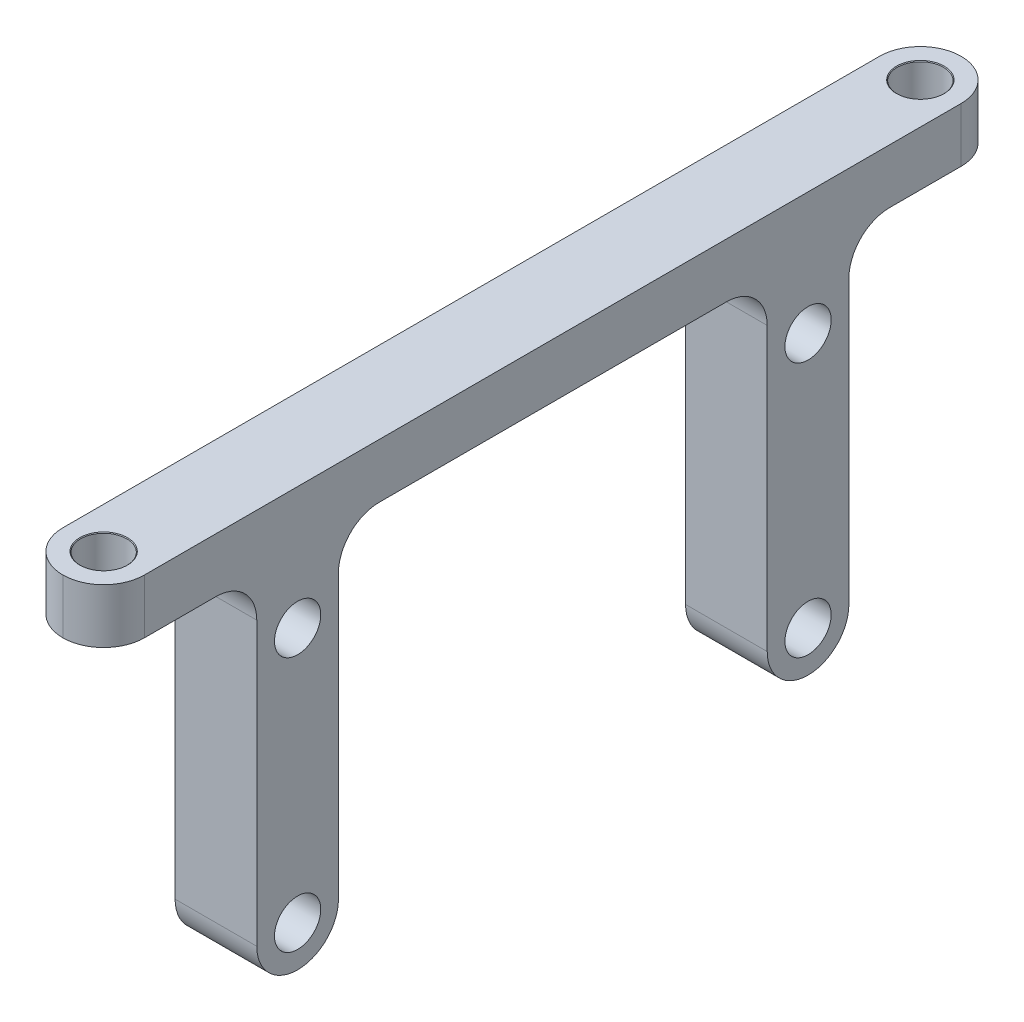
ISO-10303-21;
HEADER;
FILE_DESCRIPTION(('STEP AP214'),'2;1');
FILE_NAME('part.step','',(''),(''),'','','');
FILE_SCHEMA(('AUTOMOTIVE_DESIGN { 1 0 10303 214 1 1 1 1 }'));
ENDSEC;
DATA;
#1=APPLICATION_CONTEXT('core data for automotive mechanical design processes');
#2=APPLICATION_PROTOCOL_DEFINITION('international standard','automotive_design',2000,#1);
#3=PRODUCT_CONTEXT('',#1,'mechanical');
#4=PRODUCT('Part','Part','',(#3));
#5=PRODUCT_RELATED_PRODUCT_CATEGORY('part','',(#4));
#6=PRODUCT_DEFINITION_FORMATION('','',#4);
#7=PRODUCT_DEFINITION_CONTEXT('part definition',#1,'design');
#8=PRODUCT_DEFINITION('design','',#6,#7);
#9=PRODUCT_DEFINITION_SHAPE('','',#8);
#10=(LENGTH_UNIT() NAMED_UNIT(*) SI_UNIT(.MILLI.,.METRE.));
#11=(NAMED_UNIT(*) PLANE_ANGLE_UNIT() SI_UNIT($,.RADIAN.));
#12=(NAMED_UNIT(*) SI_UNIT($,.STERADIAN.) SOLID_ANGLE_UNIT());
#13=UNCERTAINTY_MEASURE_WITH_UNIT(LENGTH_MEASURE(1.E-05),#10,'distance_accuracy_value','');
#14=(GEOMETRIC_REPRESENTATION_CONTEXT(3) GLOBAL_UNCERTAINTY_ASSIGNED_CONTEXT((#13)) GLOBAL_UNIT_ASSIGNED_CONTEXT((#10,
#11,#12)) REPRESENTATION_CONTEXT('',''));
#15=CARTESIAN_POINT('',(0.,0.,0.));
#16=DIRECTION('',(0.,0.,1.));
#17=DIRECTION('',(1.,0.,0.));
#18=AXIS2_PLACEMENT_3D('',#15,#16,#17);
#19=CARTESIAN_POINT('',(6.,0.,0.));
#20=DIRECTION('',(-1.,0.,0.));
#21=DIRECTION('',(0.,0.,1.));
#22=AXIS2_PLACEMENT_3D('',#19,#20,#21);
#23=PLANE('',#22);
#24=DIRECTION('',(0.,0.,-1.));
#25=VECTOR('',#24,1.);
#26=CARTESIAN_POINT('',(6.,0.,-33.));
#27=LINE('',#26,#25);
#28=CARTESIAN_POINT('',(6.,0.,-24.75));
#29=VERTEX_POINT('',#28);
#30=CARTESIAN_POINT('',(6.,0.,-30.));
#31=VERTEX_POINT('',#30);
#32=EDGE_CURVE('E337',#29,#31,#27,.T.);
#33=ORIENTED_EDGE('',*,*,#32,.T.);
#34=DIRECTION('',(0.,1.,0.));
#35=VECTOR('',#34,1.);
#36=CARTESIAN_POINT('',(6.,0.,-30.));
#37=LINE('',#36,#35);
#38=CARTESIAN_POINT('',(6.,3.99999999999999,-30.));
#39=VERTEX_POINT('',#38);
#40=EDGE_CURVE('E296',#31,#39,#37,.T.);
#41=ORIENTED_EDGE('',*,*,#40,.T.);
#42=DIRECTION('',(0.,0.,1.));
#43=VECTOR('',#42,1.);
#44=CARTESIAN_POINT('',(6.,3.99999999999999,33.));
#45=LINE('',#44,#43);
#46=CARTESIAN_POINT('',(6.,3.99999999999999,30.));
#47=VERTEX_POINT('',#46);
#48=EDGE_CURVE('E331',#39,#47,#45,.T.);
#49=ORIENTED_EDGE('',*,*,#48,.T.);
#50=DIRECTION('',(0.,-1.,0.));
#51=VECTOR('',#50,1.);
#52=CARTESIAN_POINT('',(6.,0.,30.));
#53=LINE('',#52,#51);
#54=CARTESIAN_POINT('',(6.,0.,30.));
#55=VERTEX_POINT('',#54);
#56=EDGE_CURVE('E294',#47,#55,#53,.T.);
#57=ORIENTED_EDGE('',*,*,#56,.T.);
#58=DIRECTION('',(0.,0.,-1.));
#59=VECTOR('',#58,1.);
#60=CARTESIAN_POINT('',(6.,0.,21.75));
#61=LINE('',#60,#59);
#62=CARTESIAN_POINT('',(6.,0.,24.75));
#63=VERTEX_POINT('',#62);
#64=EDGE_CURVE('E336',#55,#63,#61,.T.);
#65=ORIENTED_EDGE('',*,*,#64,.T.);
#66=CARTESIAN_POINT('',(6.,-3.,24.75));
#67=DIRECTION('',(-1.,0.,0.));
#68=DIRECTION('',(0.,0.,1.));
#69=AXIS2_PLACEMENT_3D('',#66,#67,#68);
#70=CIRCLE('',#69,3.);
#71=CARTESIAN_POINT('',(6.,-3.,21.75));
#72=VERTEX_POINT('',#71);
#73=EDGE_CURVE('E292',#63,#72,#70,.T.);
#74=ORIENTED_EDGE('',*,*,#73,.T.);
#75=DIRECTION('',(0.,-1.,0.));
#76=VECTOR('',#75,1.);
#77=CARTESIAN_POINT('',(6.,-26.75,21.75));
#78=LINE('',#77,#76);
#79=CARTESIAN_POINT('',(6.,-23.75,21.75));
#80=VERTEX_POINT('',#79);
#81=EDGE_CURVE('E196',#72,#80,#78,.T.);
#82=ORIENTED_EDGE('',*,*,#81,.T.);
#83=CARTESIAN_POINT('',(6.,-23.75,18.75));
#84=DIRECTION('',(-1.,0.,0.));
#85=DIRECTION('',(0.,0.,1.));
#86=AXIS2_PLACEMENT_3D('',#83,#84,#85);
#87=CIRCLE('',#86,3.);
#88=CARTESIAN_POINT('',(6.,-26.75,18.75));
#89=VERTEX_POINT('',#88);
#90=EDGE_CURVE('E184',#80,#89,#87,.F.);
#91=ORIENTED_EDGE('',*,*,#90,.T.);
#92=CARTESIAN_POINT('',(6.,-23.75,18.75));
#93=DIRECTION('',(-1.,0.,0.));
#94=DIRECTION('',(0.,0.,1.));
#95=AXIS2_PLACEMENT_3D('',#92,#93,#94);
#96=CIRCLE('',#95,3.);
#97=CARTESIAN_POINT('',(6.,-23.75,15.75));
#98=VERTEX_POINT('',#97);
#99=EDGE_CURVE('E236',#89,#98,#96,.F.);
#100=ORIENTED_EDGE('',*,*,#99,.T.);
#101=DIRECTION('',(0.,1.,0.));
#102=VECTOR('',#101,1.);
#103=CARTESIAN_POINT('',(6.,0.,15.75));
#104=LINE('',#103,#102);
#105=CARTESIAN_POINT('',(6.,-3.,15.75));
#106=VERTEX_POINT('',#105);
#107=EDGE_CURVE('E219',#98,#106,#104,.T.);
#108=ORIENTED_EDGE('',*,*,#107,.T.);
#109=CARTESIAN_POINT('',(6.,-3.,12.75));
#110=DIRECTION('',(-1.,0.,0.));
#111=DIRECTION('',(0.,0.,1.));
#112=AXIS2_PLACEMENT_3D('',#109,#110,#111);
#113=CIRCLE('',#112,3.);
#114=CARTESIAN_POINT('',(6.,0.,12.75));
#115=VERTEX_POINT('',#114);
#116=EDGE_CURVE('E287',#106,#115,#113,.T.);
#117=ORIENTED_EDGE('',*,*,#116,.T.);
#118=DIRECTION('',(0.,0.,-1.));
#119=VECTOR('',#118,1.);
#120=CARTESIAN_POINT('',(6.,0.,-15.75));
#121=LINE('',#120,#119);
#122=CARTESIAN_POINT('',(6.,0.,-12.75));
#123=VERTEX_POINT('',#122);
#124=EDGE_CURVE('E361',#115,#123,#121,.T.);
#125=ORIENTED_EDGE('',*,*,#124,.T.);
#126=CARTESIAN_POINT('',(6.,-3.,-12.75));
#127=DIRECTION('',(-1.,0.,0.));
#128=DIRECTION('',(0.,0.,1.));
#129=AXIS2_PLACEMENT_3D('',#126,#127,#128);
#130=CIRCLE('',#129,3.);
#131=CARTESIAN_POINT('',(6.,-3.,-15.75));
#132=VERTEX_POINT('',#131);
#133=EDGE_CURVE('E283',#123,#132,#130,.T.);
#134=ORIENTED_EDGE('',*,*,#133,.T.);
#135=DIRECTION('',(0.,-1.,0.));
#136=VECTOR('',#135,1.);
#137=CARTESIAN_POINT('',(6.,-26.75,-15.75));
#138=LINE('',#137,#136);
#139=CARTESIAN_POINT('',(6.,-23.75,-15.75));
#140=VERTEX_POINT('',#139);
#141=EDGE_CURVE('E360',#132,#140,#138,.T.);
#142=ORIENTED_EDGE('',*,*,#141,.T.);
#143=CARTESIAN_POINT('',(6.,-23.75,-18.75));
#144=DIRECTION('',(-1.,0.,0.));
#145=DIRECTION('',(0.,0.,1.));
#146=AXIS2_PLACEMENT_3D('',#143,#144,#145);
#147=CIRCLE('',#146,3.);
#148=CARTESIAN_POINT('',(6.,-26.75,-18.75));
#149=VERTEX_POINT('',#148);
#150=EDGE_CURVE('E238',#140,#149,#147,.F.);
#151=ORIENTED_EDGE('',*,*,#150,.T.);
#152=CARTESIAN_POINT('',(6.,-23.75,-18.75));
#153=DIRECTION('',(-1.,0.,0.));
#154=DIRECTION('',(0.,0.,1.));
#155=AXIS2_PLACEMENT_3D('',#152,#153,#154);
#156=CIRCLE('',#155,3.);
#157=CARTESIAN_POINT('',(6.,-23.75,-21.75));
#158=VERTEX_POINT('',#157);
#159=EDGE_CURVE('E240',#149,#158,#156,.F.);
#160=ORIENTED_EDGE('',*,*,#159,.T.);
#161=DIRECTION('',(0.,1.,0.));
#162=VECTOR('',#161,1.);
#163=CARTESIAN_POINT('',(6.,0.,-21.75));
#164=LINE('',#163,#162);
#165=CARTESIAN_POINT('',(6.,-3.,-21.75));
#166=VERTEX_POINT('',#165);
#167=EDGE_CURVE('E194',#158,#166,#164,.T.);
#168=ORIENTED_EDGE('',*,*,#167,.T.);
#169=CARTESIAN_POINT('',(6.,-3.,-24.75));
#170=DIRECTION('',(-1.,0.,0.));
#171=DIRECTION('',(0.,0.,1.));
#172=AXIS2_PLACEMENT_3D('',#169,#170,#171);
#173=CIRCLE('',#172,3.);
#174=EDGE_CURVE('E279',#166,#29,#173,.T.);
#175=ORIENTED_EDGE('',*,*,#174,.T.);
#176=EDGE_LOOP('',(#33,#41,#49,#57,#65,#74,#82,#91,#100,#108,#117,#125,#134,#142,#151,#160,#168,#175));
#177=FACE_BOUND('',#176,.T.);
#178=CARTESIAN_POINT('',(6.,-5.00000000000001,-18.75));
#179=DIRECTION('',(1.,0.,0.));
#180=DIRECTION('',(0.,0.,-1.));
#181=AXIS2_PLACEMENT_3D('',#178,#179,#180);
#182=CIRCLE('',#181,1.7);
#183=CARTESIAN_POINT('',(6.,-5.00000000000001,-20.45));
#184=VERTEX_POINT('',#183);
#185=EDGE_CURVE('E346',#184,#184,#182,.T.);
#186=ORIENTED_EDGE('',*,*,#185,.F.);
#187=EDGE_LOOP('',(#186));
#188=FACE_BOUND('',#187,.T.);
#189=CARTESIAN_POINT('',(6.,-23.75,-18.75));
#190=DIRECTION('',(1.,0.,0.));
#191=DIRECTION('',(0.,0.,-1.));
#192=AXIS2_PLACEMENT_3D('',#189,#190,#191);
#193=CIRCLE('',#192,1.7);
#194=CARTESIAN_POINT('',(6.,-23.75,-20.45));
#195=VERTEX_POINT('',#194);
#196=EDGE_CURVE('E375',#195,#195,#193,.T.);
#197=ORIENTED_EDGE('',*,*,#196,.F.);
#198=EDGE_LOOP('',(#197));
#199=FACE_BOUND('',#198,.T.);
#200=CARTESIAN_POINT('',(6.,-23.75,18.75));
#201=DIRECTION('',(1.,0.,0.));
#202=DIRECTION('',(0.,0.,1.));
#203=AXIS2_PLACEMENT_3D('',#200,#201,#202);
#204=CIRCLE('',#203,1.7);
#205=CARTESIAN_POINT('',(6.,-23.75,20.45));
#206=VERTEX_POINT('',#205);
#207=EDGE_CURVE('E381',#206,#206,#204,.T.);
#208=ORIENTED_EDGE('',*,*,#207,.F.);
#209=EDGE_LOOP('',(#208));
#210=FACE_BOUND('',#209,.T.);
#211=CARTESIAN_POINT('',(6.,-5.00000000000001,18.75));
#212=DIRECTION('',(1.,0.,0.));
#213=DIRECTION('',(0.,0.,1.));
#214=AXIS2_PLACEMENT_3D('',#211,#212,#213);
#215=CIRCLE('',#214,1.7);
#216=CARTESIAN_POINT('',(6.,-5.00000000000001,20.45));
#217=VERTEX_POINT('',#216);
#218=EDGE_CURVE('E387',#217,#217,#215,.T.);
#219=ORIENTED_EDGE('',*,*,#218,.F.);
#220=EDGE_LOOP('',(#219));
#221=FACE_BOUND('',#220,.T.);
#222=ADVANCED_FACE('F37',(#177,#188,#199,#210,#221),#23,.F.);
#223=CARTESIAN_POINT('',(0.,0.,0.));
#224=DIRECTION('',(-1.,0.,0.));
#225=DIRECTION('',(0.,0.,1.));
#226=AXIS2_PLACEMENT_3D('',#223,#224,#225);
#227=PLANE('',#226);
#228=CARTESIAN_POINT('',(0.,-23.75,18.75));
#229=DIRECTION('',(1.,0.,0.));
#230=DIRECTION('',(0.,0.,1.));
#231=AXIS2_PLACEMENT_3D('',#228,#229,#230);
#232=CIRCLE('',#231,1.7);
#233=CARTESIAN_POINT('',(0.,-23.75,20.45));
#234=VERTEX_POINT('',#233);
#235=EDGE_CURVE('E384',#234,#234,#232,.T.);
#236=ORIENTED_EDGE('',*,*,#235,.T.);
#237=EDGE_LOOP('',(#236));
#238=FACE_BOUND('',#237,.T.);
#239=CARTESIAN_POINT('',(0.,-5.00000000000001,-18.75));
#240=DIRECTION('',(1.,0.,0.));
#241=DIRECTION('',(0.,0.,-1.));
#242=AXIS2_PLACEMENT_3D('',#239,#240,#241);
#243=CIRCLE('',#242,1.7);
#244=CARTESIAN_POINT('',(0.,-5.00000000000001,-20.45));
#245=VERTEX_POINT('',#244);
#246=EDGE_CURVE('E372',#245,#245,#243,.T.);
#247=ORIENTED_EDGE('',*,*,#246,.T.);
#248=EDGE_LOOP('',(#247));
#249=FACE_BOUND('',#248,.T.);
#250=DIRECTION('',(0.,0.,1.));
#251=VECTOR('',#250,1.);
#252=CARTESIAN_POINT('',(0.,3.99999999999999,33.));
#253=LINE('',#252,#251);
#254=CARTESIAN_POINT('',(0.,3.99999999999999,-30.));
#255=VERTEX_POINT('',#254);
#256=CARTESIAN_POINT('',(0.,3.99999999999999,30.));
#257=VERTEX_POINT('',#256);
#258=EDGE_CURVE('E207',#255,#257,#253,.T.);
#259=ORIENTED_EDGE('',*,*,#258,.F.);
#260=DIRECTION('',(0.,1.,0.));
#261=VECTOR('',#260,1.);
#262=CARTESIAN_POINT('',(0.,0.,-30.));
#263=LINE('',#262,#261);
#264=CARTESIAN_POINT('',(0.,0.,-30.));
#265=VERTEX_POINT('',#264);
#266=EDGE_CURVE('E314',#255,#265,#263,.F.);
#267=ORIENTED_EDGE('',*,*,#266,.T.);
#268=DIRECTION('',(0.,0.,-1.));
#269=VECTOR('',#268,1.);
#270=CARTESIAN_POINT('',(0.,0.,-33.));
#271=LINE('',#270,#269);
#272=CARTESIAN_POINT('',(0.,0.,-24.75));
#273=VERTEX_POINT('',#272);
#274=EDGE_CURVE('E203',#273,#265,#271,.T.);
#275=ORIENTED_EDGE('',*,*,#274,.F.);
#276=CARTESIAN_POINT('',(0.,-3.,-24.75));
#277=DIRECTION('',(-1.,0.,0.));
#278=DIRECTION('',(0.,0.,1.));
#279=AXIS2_PLACEMENT_3D('',#276,#277,#278);
#280=CIRCLE('',#279,3.);
#281=CARTESIAN_POINT('',(0.,-3.,-21.75));
#282=VERTEX_POINT('',#281);
#283=EDGE_CURVE('E202',#273,#282,#280,.F.);
#284=ORIENTED_EDGE('',*,*,#283,.T.);
#285=DIRECTION('',(0.,1.,0.));
#286=VECTOR('',#285,1.);
#287=CARTESIAN_POINT('',(0.,0.,-21.75));
#288=LINE('',#287,#286);
#289=CARTESIAN_POINT('',(0.,-23.75,-21.75));
#290=VERTEX_POINT('',#289);
#291=EDGE_CURVE('E191',#290,#282,#288,.T.);
#292=ORIENTED_EDGE('',*,*,#291,.F.);
#293=CARTESIAN_POINT('',(0.,-23.75,-18.75));
#294=DIRECTION('',(-1.,0.,0.));
#295=DIRECTION('',(0.,0.,1.));
#296=AXIS2_PLACEMENT_3D('',#293,#294,#295);
#297=CIRCLE('',#296,3.);
#298=CARTESIAN_POINT('',(0.,-26.75,-18.75));
#299=VERTEX_POINT('',#298);
#300=EDGE_CURVE('E173',#290,#299,#297,.T.);
#301=ORIENTED_EDGE('',*,*,#300,.T.);
#302=CARTESIAN_POINT('',(0.,-23.75,-18.75));
#303=DIRECTION('',(-1.,0.,0.));
#304=DIRECTION('',(0.,0.,1.));
#305=AXIS2_PLACEMENT_3D('',#302,#303,#304);
#306=CIRCLE('',#305,3.);
#307=CARTESIAN_POINT('',(0.,-23.75,-15.75));
#308=VERTEX_POINT('',#307);
#309=EDGE_CURVE('E185',#299,#308,#306,.T.);
#310=ORIENTED_EDGE('',*,*,#309,.T.);
#311=DIRECTION('',(0.,-1.,0.));
#312=VECTOR('',#311,1.);
#313=CARTESIAN_POINT('',(0.,-26.75,-15.75));
#314=LINE('',#313,#312);
#315=CARTESIAN_POINT('',(0.,-3.,-15.75));
#316=VERTEX_POINT('',#315);
#317=EDGE_CURVE('E204',#316,#308,#314,.T.);
#318=ORIENTED_EDGE('',*,*,#317,.F.);
#319=CARTESIAN_POINT('',(0.,-3.,-12.75));
#320=DIRECTION('',(-1.,0.,0.));
#321=DIRECTION('',(0.,0.,1.));
#322=AXIS2_PLACEMENT_3D('',#319,#320,#321);
#323=CIRCLE('',#322,3.);
#324=CARTESIAN_POINT('',(0.,0.,-12.75));
#325=VERTEX_POINT('',#324);
#326=EDGE_CURVE('E281',#316,#325,#323,.F.);
#327=ORIENTED_EDGE('',*,*,#326,.T.);
#328=DIRECTION('',(0.,0.,-1.));
#329=VECTOR('',#328,1.);
#330=CARTESIAN_POINT('',(0.,0.,-15.75));
#331=LINE('',#330,#329);
#332=CARTESIAN_POINT('',(0.,0.,12.75));
#333=VERTEX_POINT('',#332);
#334=EDGE_CURVE('E209',#333,#325,#331,.T.);
#335=ORIENTED_EDGE('',*,*,#334,.F.);
#336=CARTESIAN_POINT('',(0.,-3.,12.75));
#337=DIRECTION('',(-1.,0.,0.));
#338=DIRECTION('',(0.,0.,1.));
#339=AXIS2_PLACEMENT_3D('',#336,#337,#338);
#340=CIRCLE('',#339,3.);
#341=CARTESIAN_POINT('',(0.,-3.,15.75));
#342=VERTEX_POINT('',#341);
#343=EDGE_CURVE('E285',#333,#342,#340,.F.);
#344=ORIENTED_EDGE('',*,*,#343,.T.);
#345=DIRECTION('',(0.,1.,0.));
#346=VECTOR('',#345,1.);
#347=CARTESIAN_POINT('',(0.,0.,15.75));
#348=LINE('',#347,#346);
#349=CARTESIAN_POINT('',(0.,-23.75,15.75));
#350=VERTEX_POINT('',#349);
#351=EDGE_CURVE('E344',#350,#342,#348,.T.);
#352=ORIENTED_EDGE('',*,*,#351,.F.);
#353=CARTESIAN_POINT('',(0.,-23.75,18.75));
#354=DIRECTION('',(-1.,0.,0.));
#355=DIRECTION('',(0.,0.,1.));
#356=AXIS2_PLACEMENT_3D('',#353,#354,#355);
#357=CIRCLE('',#356,3.);
#358=CARTESIAN_POINT('',(0.,-26.75,18.75));
#359=VERTEX_POINT('',#358);
#360=EDGE_CURVE('E232',#350,#359,#357,.T.);
#361=ORIENTED_EDGE('',*,*,#360,.T.);
#362=CARTESIAN_POINT('',(0.,-23.75,18.75));
#363=DIRECTION('',(-1.,0.,0.));
#364=DIRECTION('',(0.,0.,1.));
#365=AXIS2_PLACEMENT_3D('',#362,#363,#364);
#366=CIRCLE('',#365,3.);
#367=CARTESIAN_POINT('',(0.,-23.75,21.75));
#368=VERTEX_POINT('',#367);
#369=EDGE_CURVE('E195',#359,#368,#366,.T.);
#370=ORIENTED_EDGE('',*,*,#369,.T.);
#371=DIRECTION('',(0.,-1.,0.));
#372=VECTOR('',#371,1.);
#373=CARTESIAN_POINT('',(0.,-26.75,21.75));
#374=LINE('',#373,#372);
#375=CARTESIAN_POINT('',(0.,-3.,21.75));
#376=VERTEX_POINT('',#375);
#377=EDGE_CURVE('E217',#376,#368,#374,.T.);
#378=ORIENTED_EDGE('',*,*,#377,.F.);
#379=CARTESIAN_POINT('',(0.,-3.,24.75));
#380=DIRECTION('',(-1.,0.,0.));
#381=DIRECTION('',(0.,0.,1.));
#382=AXIS2_PLACEMENT_3D('',#379,#380,#381);
#383=CIRCLE('',#382,3.);
#384=CARTESIAN_POINT('',(0.,0.,24.75));
#385=VERTEX_POINT('',#384);
#386=EDGE_CURVE('E289',#376,#385,#383,.F.);
#387=ORIENTED_EDGE('',*,*,#386,.T.);
#388=DIRECTION('',(0.,0.,-1.));
#389=VECTOR('',#388,1.);
#390=CARTESIAN_POINT('',(0.,0.,21.75));
#391=LINE('',#390,#389);
#392=CARTESIAN_POINT('',(0.,0.,30.));
#393=VERTEX_POINT('',#392);
#394=EDGE_CURVE('E215',#393,#385,#391,.T.);
#395=ORIENTED_EDGE('',*,*,#394,.F.);
#396=DIRECTION('',(0.,-1.,0.));
#397=VECTOR('',#396,1.);
#398=CARTESIAN_POINT('',(0.,3.99999999999999,30.));
#399=LINE('',#398,#397);
#400=EDGE_CURVE('E311',#393,#257,#399,.F.);
#401=ORIENTED_EDGE('',*,*,#400,.T.);
#402=EDGE_LOOP('',(#259,#267,#275,#284,#292,#301,#310,#318,#327,#335,#344,#352,#361,#370,#378,
#387,#395,#401));
#403=FACE_BOUND('',#402,.T.);
#404=CARTESIAN_POINT('',(0.,-23.75,-18.75));
#405=DIRECTION('',(1.,0.,0.));
#406=DIRECTION('',(0.,0.,-1.));
#407=AXIS2_PLACEMENT_3D('',#404,#405,#406);
#408=CIRCLE('',#407,1.7);
#409=CARTESIAN_POINT('',(0.,-23.75,-20.45));
#410=VERTEX_POINT('',#409);
#411=EDGE_CURVE('E378',#410,#410,#408,.T.);
#412=ORIENTED_EDGE('',*,*,#411,.T.);
#413=EDGE_LOOP('',(#412));
#414=FACE_BOUND('',#413,.T.);
#415=CARTESIAN_POINT('',(0.,-5.00000000000001,18.75));
#416=DIRECTION('',(1.,0.,0.));
#417=DIRECTION('',(0.,0.,1.));
#418=AXIS2_PLACEMENT_3D('',#415,#416,#417);
#419=CIRCLE('',#418,1.7);
#420=CARTESIAN_POINT('',(0.,-5.00000000000001,20.45));
#421=VERTEX_POINT('',#420);
#422=EDGE_CURVE('E223',#421,#421,#419,.T.);
#423=ORIENTED_EDGE('',*,*,#422,.T.);
#424=EDGE_LOOP('',(#423));
#425=FACE_BOUND('',#424,.T.);
#426=ADVANCED_FACE('F199',(#238,#249,#403,#414,#425),#227,.T.);
#427=CARTESIAN_POINT('',(6.,0.,15.75));
#428=DIRECTION('',(0.,0.,1.));
#429=DIRECTION('',(0.,-1.,0.));
#430=AXIS2_PLACEMENT_3D('',#427,#428,#429);
#431=PLANE('',#430);
#432=ORIENTED_EDGE('',*,*,#351,.T.);
#433=DIRECTION('',(-1.,0.,0.));
#434=VECTOR('',#433,1.);
#435=CARTESIAN_POINT('',(6.,-3.,15.75));
#436=LINE('',#435,#434);
#437=EDGE_CURVE('E270',#342,#106,#436,.F.);
#438=ORIENTED_EDGE('',*,*,#437,.T.);
#439=ORIENTED_EDGE('',*,*,#107,.F.);
#440=DIRECTION('',(-1.,0.,0.));
#441=VECTOR('',#440,1.);
#442=CARTESIAN_POINT('',(6.,-23.75,15.75));
#443=LINE('',#442,#441);
#444=EDGE_CURVE('E245',#98,#350,#443,.T.);
#445=ORIENTED_EDGE('',*,*,#444,.T.);
#446=EDGE_LOOP('',(#432,#438,#439,#445));
#447=FACE_BOUND('',#446,.T.);
#448=ADVANCED_FACE('F433',(#447),#431,.F.);
#449=CARTESIAN_POINT('',(6.,0.,-15.75));
#450=DIRECTION('',(0.,1.,0.));
#451=DIRECTION('',(0.,0.,1.));
#452=AXIS2_PLACEMENT_3D('',#449,#450,#451);
#453=PLANE('',#452);
#454=ORIENTED_EDGE('',*,*,#334,.T.);
#455=DIRECTION('',(-1.,0.,0.));
#456=VECTOR('',#455,1.);
#457=CARTESIAN_POINT('',(6.,0.,-12.75));
#458=LINE('',#457,#456);
#459=EDGE_CURVE('E268',#325,#123,#458,.F.);
#460=ORIENTED_EDGE('',*,*,#459,.T.);
#461=ORIENTED_EDGE('',*,*,#124,.F.);
#462=DIRECTION('',(-1.,0.,0.));
#463=VECTOR('',#462,1.);
#464=CARTESIAN_POINT('',(0.,0.,12.75));
#465=LINE('',#464,#463);
#466=EDGE_CURVE('E265',#115,#333,#465,.T.);
#467=ORIENTED_EDGE('',*,*,#466,.T.);
#468=EDGE_LOOP('',(#454,#460,#461,#467));
#469=FACE_BOUND('',#468,.T.);
#470=ADVANCED_FACE('F351',(#469),#453,.F.);
#471=CARTESIAN_POINT('',(6.,-26.75,-15.75));
#472=DIRECTION('',(0.,0.,-1.));
#473=DIRECTION('',(0.,1.,0.));
#474=AXIS2_PLACEMENT_3D('',#471,#472,#473);
#475=PLANE('',#474);
#476=ORIENTED_EDGE('',*,*,#141,.F.);
#477=DIRECTION('',(-1.,0.,0.));
#478=VECTOR('',#477,1.);
#479=CARTESIAN_POINT('',(0.,-3.,-15.75));
#480=LINE('',#479,#478);
#481=EDGE_CURVE('E262',#132,#316,#480,.T.);
#482=ORIENTED_EDGE('',*,*,#481,.T.);
#483=ORIENTED_EDGE('',*,*,#317,.T.);
#484=DIRECTION('',(-1.,0.,0.));
#485=VECTOR('',#484,1.);
#486=CARTESIAN_POINT('',(6.,-23.75,-15.75));
#487=LINE('',#486,#485);
#488=EDGE_CURVE('E242',#308,#140,#487,.F.);
#489=ORIENTED_EDGE('',*,*,#488,.T.);
#490=EDGE_LOOP('',(#476,#482,#483,#489));
#491=FACE_BOUND('',#490,.T.);
#492=ADVANCED_FACE('F363',(#491),#475,.F.);
#493=CARTESIAN_POINT('',(6.,0.,-21.75));
#494=DIRECTION('',(0.,0.,1.));
#495=DIRECTION('',(1.,0.,0.));
#496=AXIS2_PLACEMENT_3D('',#493,#494,#495);
#497=PLANE('',#496);
#498=ORIENTED_EDGE('',*,*,#291,.T.);
#499=DIRECTION('',(-1.,0.,0.));
#500=VECTOR('',#499,1.);
#501=CARTESIAN_POINT('',(6.,-3.,-21.75));
#502=LINE('',#501,#500);
#503=EDGE_CURVE('E260',#282,#166,#502,.F.);
#504=ORIENTED_EDGE('',*,*,#503,.T.);
#505=ORIENTED_EDGE('',*,*,#167,.F.);
#506=DIRECTION('',(-1.,0.,0.));
#507=VECTOR('',#506,1.);
#508=CARTESIAN_POINT('',(6.,-23.75,-21.75));
#509=LINE('',#508,#507);
#510=EDGE_CURVE('E177',#158,#290,#509,.T.);
#511=ORIENTED_EDGE('',*,*,#510,.T.);
#512=EDGE_LOOP('',(#498,#504,#505,#511));
#513=FACE_BOUND('',#512,.T.);
#514=ADVANCED_FACE('F190',(#513),#497,.F.);
#515=CARTESIAN_POINT('',(6.,0.,-33.));
#516=DIRECTION('',(0.,1.,0.));
#517=DIRECTION('',(0.,0.,1.));
#518=AXIS2_PLACEMENT_3D('',#515,#516,#517);
#519=PLANE('',#518);
#520=CARTESIAN_POINT('',(3.,0.,-30.));
#521=DIRECTION('',(0.,1.,0.));
#522=DIRECTION('',(0.,0.,1.));
#523=AXIS2_PLACEMENT_3D('',#520,#521,#522);
#524=CIRCLE('',#523,1.7);
#525=CARTESIAN_POINT('',(3.,0.,-28.3));
#526=VERTEX_POINT('',#525);
#527=EDGE_CURVE('E225',#526,#526,#524,.T.);
#528=ORIENTED_EDGE('',*,*,#527,.T.);
#529=EDGE_LOOP('',(#528));
#530=FACE_BOUND('',#529,.T.);
#531=CARTESIAN_POINT('',(3.,0.,-30.));
#532=DIRECTION('',(0.,1.,0.));
#533=DIRECTION('',(0.,0.,1.));
#534=AXIS2_PLACEMENT_3D('',#531,#532,#533);
#535=CIRCLE('',#534,3.);
#536=CARTESIAN_POINT('',(3.,0.,-33.));
#537=VERTEX_POINT('',#536);
#538=EDGE_CURVE('E307',#265,#537,#535,.F.);
#539=ORIENTED_EDGE('',*,*,#538,.T.);
#540=CARTESIAN_POINT('',(3.,0.,-30.));
#541=DIRECTION('',(0.,1.,0.));
#542=DIRECTION('',(0.,0.,1.));
#543=AXIS2_PLACEMENT_3D('',#540,#541,#542);
#544=CIRCLE('',#543,3.);
#545=EDGE_CURVE('E309',#537,#31,#544,.F.);
#546=ORIENTED_EDGE('',*,*,#545,.T.);
#547=ORIENTED_EDGE('',*,*,#32,.F.);
#548=DIRECTION('',(-1.,0.,0.));
#549=VECTOR('',#548,1.);
#550=CARTESIAN_POINT('',(0.,0.,-24.75));
#551=LINE('',#550,#549);
#552=EDGE_CURVE('E251',#29,#273,#551,.T.);
#553=ORIENTED_EDGE('',*,*,#552,.T.);
#554=ORIENTED_EDGE('',*,*,#274,.T.);
#555=EDGE_LOOP('',(#539,#546,#547,#553,#554));
#556=FACE_BOUND('',#555,.T.);
#557=ADVANCED_FACE('F408',(#530,#556),#519,.F.);
#558=CARTESIAN_POINT('',(6.,3.99999999999999,33.));
#559=DIRECTION('',(0.,-1.,0.));
#560=DIRECTION('',(0.,0.,-1.));
#561=AXIS2_PLACEMENT_3D('',#558,#559,#560);
#562=PLANE('',#561);
#563=CARTESIAN_POINT('',(3.,3.99999999999999,-30.));
#564=DIRECTION('',(0.,1.,0.));
#565=DIRECTION('',(0.,0.,1.));
#566=AXIS2_PLACEMENT_3D('',#563,#564,#565);
#567=CIRCLE('',#566,1.75);
#568=CARTESIAN_POINT('',(3.,3.99999999999999,-28.25));
#569=VERTEX_POINT('',#568);
#570=EDGE_CURVE('E253',#569,#569,#567,.T.);
#571=ORIENTED_EDGE('',*,*,#570,.F.);
#572=EDGE_LOOP('',(#571));
#573=FACE_BOUND('',#572,.T.);
#574=CARTESIAN_POINT('',(3.,3.99999999999999,30.));
#575=DIRECTION('',(0.,1.,0.));
#576=DIRECTION('',(0.,0.,1.));
#577=AXIS2_PLACEMENT_3D('',#574,#575,#576);
#578=CIRCLE('',#577,1.75);
#579=CARTESIAN_POINT('',(3.,3.99999999999999,31.75));
#580=VERTEX_POINT('',#579);
#581=EDGE_CURVE('E227',#580,#580,#578,.T.);
#582=ORIENTED_EDGE('',*,*,#581,.F.);
#583=EDGE_LOOP('',(#582));
#584=FACE_BOUND('',#583,.T.);
#585=ORIENTED_EDGE('',*,*,#48,.F.);
#586=CARTESIAN_POINT('',(3.,3.99999999999999,-30.));
#587=DIRECTION('',(0.,-1.,0.));
#588=DIRECTION('',(0.,0.,-1.));
#589=AXIS2_PLACEMENT_3D('',#586,#587,#588);
#590=CIRCLE('',#589,3.);
#591=CARTESIAN_POINT('',(3.,3.99999999999999,-33.));
#592=VERTEX_POINT('',#591);
#593=EDGE_CURVE('E305',#39,#592,#590,.F.);
#594=ORIENTED_EDGE('',*,*,#593,.T.);
#595=CARTESIAN_POINT('',(3.,3.99999999999999,-30.));
#596=DIRECTION('',(0.,-1.,0.));
#597=DIRECTION('',(0.,0.,-1.));
#598=AXIS2_PLACEMENT_3D('',#595,#596,#597);
#599=CIRCLE('',#598,3.);
#600=EDGE_CURVE('E303',#592,#255,#599,.F.);
#601=ORIENTED_EDGE('',*,*,#600,.T.);
#602=ORIENTED_EDGE('',*,*,#258,.T.);
#603=CARTESIAN_POINT('',(3.,3.99999999999999,30.));
#604=DIRECTION('',(0.,-1.,0.));
#605=DIRECTION('',(0.,0.,-1.));
#606=AXIS2_PLACEMENT_3D('',#603,#604,#605);
#607=CIRCLE('',#606,3.);
#608=CARTESIAN_POINT('',(3.,3.99999999999999,33.));
#609=VERTEX_POINT('',#608);
#610=EDGE_CURVE('E301',#257,#609,#607,.F.);
#611=ORIENTED_EDGE('',*,*,#610,.T.);
#612=CARTESIAN_POINT('',(3.,3.99999999999999,30.));
#613=DIRECTION('',(0.,-1.,0.));
#614=DIRECTION('',(0.,0.,-1.));
#615=AXIS2_PLACEMENT_3D('',#612,#613,#614);
#616=CIRCLE('',#615,3.);
#617=EDGE_CURVE('E299',#609,#47,#616,.F.);
#618=ORIENTED_EDGE('',*,*,#617,.T.);
#619=EDGE_LOOP('',(#585,#594,#601,#602,#611,#618));
#620=FACE_BOUND('',#619,.T.);
#621=ADVANCED_FACE('F330',(#573,#584,#620),#562,.F.);
#622=CARTESIAN_POINT('',(6.,0.,21.75));
#623=DIRECTION('',(0.,1.,0.));
#624=DIRECTION('',(0.,0.,1.));
#625=AXIS2_PLACEMENT_3D('',#622,#623,#624);
#626=PLANE('',#625);
#627=CARTESIAN_POINT('',(3.,0.,30.));
#628=DIRECTION('',(0.,1.,0.));
#629=DIRECTION('',(0.,0.,1.));
#630=AXIS2_PLACEMENT_3D('',#627,#628,#629);
#631=CIRCLE('',#630,1.7);
#632=CARTESIAN_POINT('',(3.,0.,31.7));
#633=VERTEX_POINT('',#632);
#634=EDGE_CURVE('E220',#633,#633,#631,.T.);
#635=ORIENTED_EDGE('',*,*,#634,.T.);
#636=EDGE_LOOP('',(#635));
#637=FACE_BOUND('',#636,.T.);
#638=CARTESIAN_POINT('',(3.,0.,30.));
#639=DIRECTION('',(0.,1.,0.));
#640=DIRECTION('',(0.,0.,1.));
#641=AXIS2_PLACEMENT_3D('',#638,#639,#640);
#642=CIRCLE('',#641,3.);
#643=CARTESIAN_POINT('',(3.,0.,33.));
#644=VERTEX_POINT('',#643);
#645=EDGE_CURVE('E46',#55,#644,#642,.F.);
#646=ORIENTED_EDGE('',*,*,#645,.T.);
#647=CARTESIAN_POINT('',(3.,0.,30.));
#648=DIRECTION('',(0.,1.,0.));
#649=DIRECTION('',(0.,0.,1.));
#650=AXIS2_PLACEMENT_3D('',#647,#648,#649);
#651=CIRCLE('',#650,3.);
#652=EDGE_CURVE('E11',#644,#393,#651,.F.);
#653=ORIENTED_EDGE('',*,*,#652,.T.);
#654=ORIENTED_EDGE('',*,*,#394,.T.);
#655=DIRECTION('',(-1.,0.,0.));
#656=VECTOR('',#655,1.);
#657=CARTESIAN_POINT('',(6.,0.,24.75));
#658=LINE('',#657,#656);
#659=EDGE_CURVE('E275',#385,#63,#658,.F.);
#660=ORIENTED_EDGE('',*,*,#659,.T.);
#661=ORIENTED_EDGE('',*,*,#64,.F.);
#662=EDGE_LOOP('',(#646,#653,#654,#660,#661));
#663=FACE_BOUND('',#662,.T.);
#664=ADVANCED_FACE('F407',(#637,#663),#626,.F.);
#665=CARTESIAN_POINT('',(6.,-26.75,21.75));
#666=DIRECTION('',(0.,0.,-1.));
#667=DIRECTION('',(-1.,0.,0.));
#668=AXIS2_PLACEMENT_3D('',#665,#666,#667);
#669=PLANE('',#668);
#670=ORIENTED_EDGE('',*,*,#81,.F.);
#671=DIRECTION('',(-1.,0.,0.));
#672=VECTOR('',#671,1.);
#673=CARTESIAN_POINT('',(0.,-3.,21.75));
#674=LINE('',#673,#672);
#675=EDGE_CURVE('E272',#72,#376,#674,.T.);
#676=ORIENTED_EDGE('',*,*,#675,.T.);
#677=ORIENTED_EDGE('',*,*,#377,.T.);
#678=DIRECTION('',(-1.,0.,0.));
#679=VECTOR('',#678,1.);
#680=CARTESIAN_POINT('',(6.,-23.75,21.75));
#681=LINE('',#680,#679);
#682=EDGE_CURVE('E248',#368,#80,#681,.F.);
#683=ORIENTED_EDGE('',*,*,#682,.T.);
#684=EDGE_LOOP('',(#670,#676,#677,#683));
#685=FACE_BOUND('',#684,.T.);
#686=ADVANCED_FACE('F440',(#685),#669,.F.);
#687=CARTESIAN_POINT('',(6.,-5.00000000000001,-18.75));
#688=DIRECTION('',(-1.,0.,0.));
#689=DIRECTION('',(0.,0.,1.));
#690=AXIS2_PLACEMENT_3D('',#687,#688,#689);
#691=CYLINDRICAL_SURFACE('',#690,1.7);
#692=ORIENTED_EDGE('',*,*,#185,.T.);
#693=EDGE_LOOP('',(#692));
#694=FACE_BOUND('',#693,.T.);
#695=ORIENTED_EDGE('',*,*,#246,.F.);
#696=EDGE_LOOP('',(#695));
#697=FACE_BOUND('',#696,.T.);
#698=ADVANCED_FACE('F437',(#694,#697),#691,.F.);
#699=CARTESIAN_POINT('',(6.,-23.75,-18.75));
#700=DIRECTION('',(-1.,0.,0.));
#701=DIRECTION('',(0.,0.,1.));
#702=AXIS2_PLACEMENT_3D('',#699,#700,#701);
#703=CYLINDRICAL_SURFACE('',#702,1.7);
#704=ORIENTED_EDGE('',*,*,#196,.T.);
#705=EDGE_LOOP('',(#704));
#706=FACE_BOUND('',#705,.T.);
#707=ORIENTED_EDGE('',*,*,#411,.F.);
#708=EDGE_LOOP('',(#707));
#709=FACE_BOUND('',#708,.T.);
#710=ADVANCED_FACE('F586',(#706,#709),#703,.F.);
#711=CARTESIAN_POINT('',(6.,-23.75,18.75));
#712=DIRECTION('',(-1.,0.,0.));
#713=DIRECTION('',(0.,0.,1.));
#714=AXIS2_PLACEMENT_3D('',#711,#712,#713);
#715=CYLINDRICAL_SURFACE('',#714,1.7);
#716=ORIENTED_EDGE('',*,*,#207,.T.);
#717=EDGE_LOOP('',(#716));
#718=FACE_BOUND('',#717,.T.);
#719=ORIENTED_EDGE('',*,*,#235,.F.);
#720=EDGE_LOOP('',(#719));
#721=FACE_BOUND('',#720,.T.);
#722=ADVANCED_FACE('F575',(#718,#721),#715,.F.);
#723=CARTESIAN_POINT('',(6.,-5.00000000000001,18.75));
#724=DIRECTION('',(-1.,0.,0.));
#725=DIRECTION('',(0.,0.,1.));
#726=AXIS2_PLACEMENT_3D('',#723,#724,#725);
#727=CYLINDRICAL_SURFACE('',#726,1.7);
#728=ORIENTED_EDGE('',*,*,#218,.T.);
#729=EDGE_LOOP('',(#728));
#730=FACE_BOUND('',#729,.T.);
#731=ORIENTED_EDGE('',*,*,#422,.F.);
#732=EDGE_LOOP('',(#731));
#733=FACE_BOUND('',#732,.T.);
#734=ADVANCED_FACE('F424',(#730,#733),#727,.F.);
#735=CARTESIAN_POINT('',(3.,3.99999999999999,30.));
#736=DIRECTION('',(0.,1.,0.));
#737=DIRECTION('',(0.,0.,1.));
#738=AXIS2_PLACEMENT_3D('',#735,#736,#737);
#739=CYLINDRICAL_SURFACE('',#738,1.7);
#740=CARTESIAN_POINT('',(3.,3.94999999999999,30.));
#741=DIRECTION('',(0.,1.,0.));
#742=DIRECTION('',(0.,0.,1.));
#743=AXIS2_PLACEMENT_3D('',#740,#741,#742);
#744=CIRCLE('',#743,1.7);
#745=CARTESIAN_POINT('',(3.,3.94999999999999,31.7));
#746=VERTEX_POINT('',#745);
#747=EDGE_CURVE('E224',#746,#746,#744,.T.);
#748=ORIENTED_EDGE('',*,*,#747,.T.);
#749=EDGE_LOOP('',(#748));
#750=FACE_BOUND('',#749,.T.);
#751=ORIENTED_EDGE('',*,*,#634,.F.);
#752=EDGE_LOOP('',(#751));
#753=FACE_BOUND('',#752,.T.);
#754=ADVANCED_FACE('F415',(#750,#753),#739,.F.);
#755=CARTESIAN_POINT('',(3.,3.99999999999999,30.));
#756=DIRECTION('',(0.,1.,0.));
#757=DIRECTION('',(0.,0.,1.));
#758=AXIS2_PLACEMENT_3D('',#755,#756,#757);
#759=CONICAL_SURFACE('',#758,1.75,0.785398163397466);
#760=ORIENTED_EDGE('',*,*,#747,.F.);
#761=EDGE_LOOP('',(#760));
#762=FACE_BOUND('',#761,.T.);
#763=ORIENTED_EDGE('',*,*,#581,.T.);
#764=EDGE_LOOP('',(#763));
#765=FACE_BOUND('',#764,.T.);
#766=ADVANCED_FACE('F412',(#762,#765),#759,.F.);
#767=CARTESIAN_POINT('',(3.,3.99999999999999,-30.));
#768=DIRECTION('',(0.,1.,0.));
#769=DIRECTION('',(0.,0.,1.));
#770=AXIS2_PLACEMENT_3D('',#767,#768,#769);
#771=CYLINDRICAL_SURFACE('',#770,1.7);
#772=CARTESIAN_POINT('',(3.,3.94999999999999,-30.));
#773=DIRECTION('',(0.,1.,0.));
#774=DIRECTION('',(0.,0.,1.));
#775=AXIS2_PLACEMENT_3D('',#772,#773,#774);
#776=CIRCLE('',#775,1.7);
#777=CARTESIAN_POINT('',(3.,3.94999999999999,-28.3));
#778=VERTEX_POINT('',#777);
#779=EDGE_CURVE('E228',#778,#778,#776,.T.);
#780=ORIENTED_EDGE('',*,*,#779,.T.);
#781=EDGE_LOOP('',(#780));
#782=FACE_BOUND('',#781,.T.);
#783=ORIENTED_EDGE('',*,*,#527,.F.);
#784=EDGE_LOOP('',(#783));
#785=FACE_BOUND('',#784,.T.);
#786=ADVANCED_FACE('F414',(#782,#785),#771,.F.);
#787=CARTESIAN_POINT('',(3.,3.99999999999999,-30.));
#788=DIRECTION('',(0.,1.,0.));
#789=DIRECTION('',(0.,0.,1.));
#790=AXIS2_PLACEMENT_3D('',#787,#788,#789);
#791=CONICAL_SURFACE('',#790,1.75,0.785398163397466);
#792=ORIENTED_EDGE('',*,*,#779,.F.);
#793=EDGE_LOOP('',(#792));
#794=FACE_BOUND('',#793,.T.);
#795=ORIENTED_EDGE('',*,*,#570,.T.);
#796=EDGE_LOOP('',(#795));
#797=FACE_BOUND('',#796,.T.);
#798=ADVANCED_FACE('F403',(#794,#797),#791,.F.);
#799=CARTESIAN_POINT('',(6.,-23.75,-18.75));
#800=DIRECTION('',(-1.,0.,0.));
#801=DIRECTION('',(0.,0.,1.));
#802=AXIS2_PLACEMENT_3D('',#799,#800,#801);
#803=CYLINDRICAL_SURFACE('',#802,3.);
#804=DIRECTION('',(-1.,0.,0.));
#805=VECTOR('',#804,1.);
#806=CARTESIAN_POINT('',(6.,-26.75,-18.75));
#807=LINE('',#806,#805);
#808=EDGE_CURVE('E179',#149,#299,#807,.T.);
#809=ORIENTED_EDGE('',*,*,#808,.F.);
#810=ORIENTED_EDGE('',*,*,#150,.F.);
#811=ORIENTED_EDGE('',*,*,#488,.F.);
#812=ORIENTED_EDGE('',*,*,#309,.F.);
#813=EDGE_LOOP('',(#809,#810,#811,#812));
#814=FACE_BOUND('',#813,.T.);
#815=ADVANCED_FACE('F462',(#814),#803,.T.);
#816=CARTESIAN_POINT('',(6.,-23.75,-18.75));
#817=DIRECTION('',(-1.,0.,0.));
#818=DIRECTION('',(0.,0.,1.));
#819=AXIS2_PLACEMENT_3D('',#816,#817,#818);
#820=CYLINDRICAL_SURFACE('',#819,3.);
#821=ORIENTED_EDGE('',*,*,#159,.F.);
#822=ORIENTED_EDGE('',*,*,#808,.T.);
#823=ORIENTED_EDGE('',*,*,#300,.F.);
#824=ORIENTED_EDGE('',*,*,#510,.F.);
#825=EDGE_LOOP('',(#821,#822,#823,#824));
#826=FACE_BOUND('',#825,.T.);
#827=ADVANCED_FACE('F176',(#826),#820,.T.);
#828=CARTESIAN_POINT('',(6.,-23.75,18.75));
#829=DIRECTION('',(-1.,0.,0.));
#830=DIRECTION('',(0.,0.,1.));
#831=AXIS2_PLACEMENT_3D('',#828,#829,#830);
#832=CYLINDRICAL_SURFACE('',#831,3.);
#833=DIRECTION('',(-1.,0.,0.));
#834=VECTOR('',#833,1.);
#835=CARTESIAN_POINT('',(6.,-26.75,18.75));
#836=LINE('',#835,#834);
#837=EDGE_CURVE('E254',#89,#359,#836,.T.);
#838=ORIENTED_EDGE('',*,*,#837,.F.);
#839=ORIENTED_EDGE('',*,*,#90,.F.);
#840=ORIENTED_EDGE('',*,*,#682,.F.);
#841=ORIENTED_EDGE('',*,*,#369,.F.);
#842=EDGE_LOOP('',(#838,#839,#840,#841));
#843=FACE_BOUND('',#842,.T.);
#844=ADVANCED_FACE('F461',(#843),#832,.T.);
#845=CARTESIAN_POINT('',(6.,-23.75,18.75));
#846=DIRECTION('',(-1.,0.,0.));
#847=DIRECTION('',(0.,0.,1.));
#848=AXIS2_PLACEMENT_3D('',#845,#846,#847);
#849=CYLINDRICAL_SURFACE('',#848,3.);
#850=ORIENTED_EDGE('',*,*,#99,.F.);
#851=ORIENTED_EDGE('',*,*,#837,.T.);
#852=ORIENTED_EDGE('',*,*,#360,.F.);
#853=ORIENTED_EDGE('',*,*,#444,.F.);
#854=EDGE_LOOP('',(#850,#851,#852,#853));
#855=FACE_BOUND('',#854,.T.);
#856=ADVANCED_FACE('F466',(#855),#849,.T.);
#857=CARTESIAN_POINT('',(6.,-3.,-24.75));
#858=DIRECTION('',(1.,0.,0.));
#859=DIRECTION('',(0.,0.,-1.));
#860=AXIS2_PLACEMENT_3D('',#857,#858,#859);
#861=CYLINDRICAL_SURFACE('',#860,3.);
#862=ORIENTED_EDGE('',*,*,#174,.F.);
#863=ORIENTED_EDGE('',*,*,#503,.F.);
#864=ORIENTED_EDGE('',*,*,#283,.F.);
#865=ORIENTED_EDGE('',*,*,#552,.F.);
#866=EDGE_LOOP('',(#862,#863,#864,#865));
#867=FACE_BOUND('',#866,.T.);
#868=ADVANCED_FACE('F469',(#867),#861,.F.);
#869=CARTESIAN_POINT('',(6.,-3.,-12.75));
#870=DIRECTION('',(1.,0.,0.));
#871=DIRECTION('',(0.,0.,-1.));
#872=AXIS2_PLACEMENT_3D('',#869,#870,#871);
#873=CYLINDRICAL_SURFACE('',#872,3.);
#874=ORIENTED_EDGE('',*,*,#133,.F.);
#875=ORIENTED_EDGE('',*,*,#459,.F.);
#876=ORIENTED_EDGE('',*,*,#326,.F.);
#877=ORIENTED_EDGE('',*,*,#481,.F.);
#878=EDGE_LOOP('',(#874,#875,#876,#877));
#879=FACE_BOUND('',#878,.T.);
#880=ADVANCED_FACE('F357',(#879),#873,.F.);
#881=CARTESIAN_POINT('',(6.,-3.,12.75));
#882=DIRECTION('',(1.,0.,0.));
#883=DIRECTION('',(0.,0.,-1.));
#884=AXIS2_PLACEMENT_3D('',#881,#882,#883);
#885=CYLINDRICAL_SURFACE('',#884,3.);
#886=ORIENTED_EDGE('',*,*,#116,.F.);
#887=ORIENTED_EDGE('',*,*,#437,.F.);
#888=ORIENTED_EDGE('',*,*,#343,.F.);
#889=ORIENTED_EDGE('',*,*,#466,.F.);
#890=EDGE_LOOP('',(#886,#887,#888,#889));
#891=FACE_BOUND('',#890,.T.);
#892=ADVANCED_FACE('F479',(#891),#885,.F.);
#893=CARTESIAN_POINT('',(6.,-3.,24.75));
#894=DIRECTION('',(1.,0.,0.));
#895=DIRECTION('',(0.,0.,-1.));
#896=AXIS2_PLACEMENT_3D('',#893,#894,#895);
#897=CYLINDRICAL_SURFACE('',#896,3.);
#898=ORIENTED_EDGE('',*,*,#73,.F.);
#899=ORIENTED_EDGE('',*,*,#659,.F.);
#900=ORIENTED_EDGE('',*,*,#386,.F.);
#901=ORIENTED_EDGE('',*,*,#675,.F.);
#902=EDGE_LOOP('',(#898,#899,#900,#901));
#903=FACE_BOUND('',#902,.T.);
#904=ADVANCED_FACE('F482',(#903),#897,.F.);
#905=CARTESIAN_POINT('',(3.,3.99999999999999,-30.));
#906=DIRECTION('',(0.,-1.,0.));
#907=DIRECTION('',(0.,0.,-1.));
#908=AXIS2_PLACEMENT_3D('',#905,#906,#907);
#909=CYLINDRICAL_SURFACE('',#908,3.);
#910=DIRECTION('',(0.,1.,0.));
#911=VECTOR('',#910,1.);
#912=CARTESIAN_POINT('',(3.,3.99999999999999,-33.));
#913=LINE('',#912,#911);
#914=EDGE_CURVE('E257',#537,#592,#913,.T.);
#915=ORIENTED_EDGE('',*,*,#914,.F.);
#916=ORIENTED_EDGE('',*,*,#538,.F.);
#917=ORIENTED_EDGE('',*,*,#266,.F.);
#918=ORIENTED_EDGE('',*,*,#600,.F.);
#919=EDGE_LOOP('',(#915,#916,#917,#918));
#920=FACE_BOUND('',#919,.T.);
#921=ADVANCED_FACE('F486',(#920),#909,.T.);
#922=CARTESIAN_POINT('',(3.,0.,-30.));
#923=DIRECTION('',(0.,1.,0.));
#924=DIRECTION('',(0.,0.,1.));
#925=AXIS2_PLACEMENT_3D('',#922,#923,#924);
#926=CYLINDRICAL_SURFACE('',#925,3.);
#927=ORIENTED_EDGE('',*,*,#545,.F.);
#928=ORIENTED_EDGE('',*,*,#914,.T.);
#929=ORIENTED_EDGE('',*,*,#593,.F.);
#930=ORIENTED_EDGE('',*,*,#40,.F.);
#931=EDGE_LOOP('',(#927,#928,#929,#930));
#932=FACE_BOUND('',#931,.T.);
#933=ADVANCED_FACE('F488',(#932),#926,.T.);
#934=CARTESIAN_POINT('',(3.,0.,30.));
#935=DIRECTION('',(0.,-1.,0.));
#936=DIRECTION('',(0.,0.,-1.));
#937=AXIS2_PLACEMENT_3D('',#934,#935,#936);
#938=CYLINDRICAL_SURFACE('',#937,3.);
#939=ORIENTED_EDGE('',*,*,#56,.F.);
#940=ORIENTED_EDGE('',*,*,#617,.F.);
#941=DIRECTION('',(0.,-1.,0.));
#942=VECTOR('',#941,1.);
#943=CARTESIAN_POINT('',(3.,0.,33.));
#944=LINE('',#943,#942);
#945=EDGE_CURVE('E41',#644,#609,#944,.F.);
#946=ORIENTED_EDGE('',*,*,#945,.F.);
#947=ORIENTED_EDGE('',*,*,#645,.F.);
#948=EDGE_LOOP('',(#939,#940,#946,#947));
#949=FACE_BOUND('',#948,.T.);
#950=ADVANCED_FACE('F39',(#949),#938,.T.);
#951=CARTESIAN_POINT('',(3.,0.,30.));
#952=DIRECTION('',(0.,1.,0.));
#953=DIRECTION('',(0.,0.,1.));
#954=AXIS2_PLACEMENT_3D('',#951,#952,#953);
#955=CYLINDRICAL_SURFACE('',#954,3.);
#956=ORIENTED_EDGE('',*,*,#610,.F.);
#957=ORIENTED_EDGE('',*,*,#400,.F.);
#958=ORIENTED_EDGE('',*,*,#652,.F.);
#959=ORIENTED_EDGE('',*,*,#945,.T.);
#960=EDGE_LOOP('',(#956,#957,#958,#959));
#961=FACE_BOUND('',#960,.T.);
#962=ADVANCED_FACE('F322',(#961),#955,.T.);
#963=CLOSED_SHELL('',(#222,#426,#448,#470,#492,#514,#557,#621,#664,#686,#698,#710,#722,#734,
#754,#766,#786,#798,#815,#827,#844,#856,#868,#880,#892,#904,#921,#933,#950,#962));
#964=MANIFOLD_SOLID_BREP('B2',#963);
#965=ADVANCED_BREP_SHAPE_REPRESENTATION('',(#18,#964),#14);
#966=SHAPE_DEFINITION_REPRESENTATION(#9,#965);
ENDSEC;
END-ISO-10303-21;
